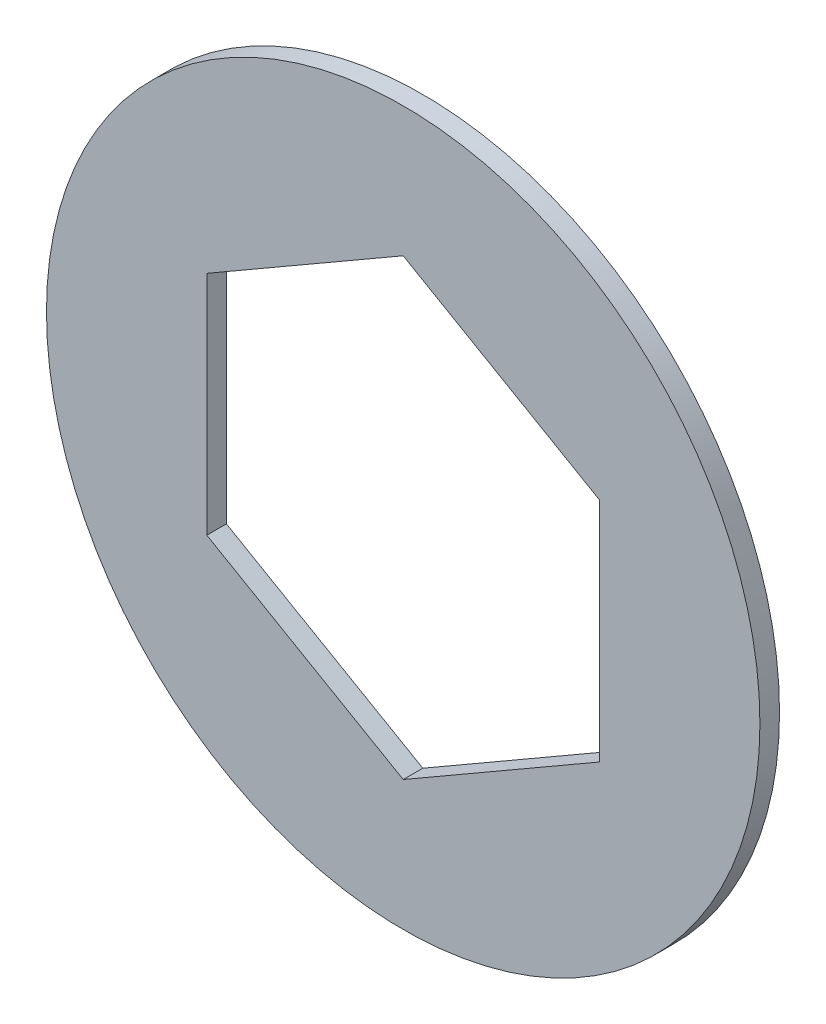
ISO-10303-21;
HEADER;
FILE_DESCRIPTION(('STEP AP214'),'2;1');
FILE_NAME('part.step','',(''),(''),'','','');
FILE_SCHEMA(('AUTOMOTIVE_DESIGN { 1 0 10303 214 1 1 1 1 }'));
ENDSEC;
DATA;
#1=APPLICATION_CONTEXT('core data for automotive mechanical design processes');
#2=APPLICATION_PROTOCOL_DEFINITION('international standard','automotive_design',2000,#1);
#3=PRODUCT_CONTEXT('',#1,'mechanical');
#4=PRODUCT('Part','Part','',(#3));
#5=PRODUCT_RELATED_PRODUCT_CATEGORY('part','',(#4));
#6=PRODUCT_DEFINITION_FORMATION('','',#4);
#7=PRODUCT_DEFINITION_CONTEXT('part definition',#1,'design');
#8=PRODUCT_DEFINITION('design','',#6,#7);
#9=PRODUCT_DEFINITION_SHAPE('','',#8);
#10=(LENGTH_UNIT() NAMED_UNIT(*) SI_UNIT(.MILLI.,.METRE.));
#11=(NAMED_UNIT(*) PLANE_ANGLE_UNIT() SI_UNIT($,.RADIAN.));
#12=(NAMED_UNIT(*) SI_UNIT($,.STERADIAN.) SOLID_ANGLE_UNIT());
#13=UNCERTAINTY_MEASURE_WITH_UNIT(LENGTH_MEASURE(1.E-05),#10,'distance_accuracy_value','');
#14=(GEOMETRIC_REPRESENTATION_CONTEXT(3) GLOBAL_UNCERTAINTY_ASSIGNED_CONTEXT((#13)) GLOBAL_UNIT_ASSIGNED_CONTEXT((#10,
#11,#12)) REPRESENTATION_CONTEXT('',''));
#15=CARTESIAN_POINT('',(0.,0.,0.));
#16=DIRECTION('',(0.,0.,1.));
#17=DIRECTION('',(1.,0.,0.));
#18=AXIS2_PLACEMENT_3D('',#15,#16,#17);
#19=CARTESIAN_POINT('',(0.,0.,2.5));
#20=DIRECTION('',(0.,0.,1.));
#21=DIRECTION('',(1.,0.,0.));
#22=AXIS2_PLACEMENT_3D('',#19,#20,#21);
#23=PLANE('',#22);
#24=CARTESIAN_POINT('',(0.,0.,2.5));
#25=DIRECTION('',(0.,0.,1.));
#26=DIRECTION('',(1.,0.,0.));
#27=AXIS2_PLACEMENT_3D('',#24,#25,#26);
#28=CIRCLE('',#27,45.5);
#29=CARTESIAN_POINT('',(45.5,0.,2.5));
#30=VERTEX_POINT('',#29);
#31=EDGE_CURVE('E11',#30,#30,#28,.T.);
#32=ORIENTED_EDGE('',*,*,#31,.T.);
#33=EDGE_LOOP('',(#32));
#34=FACE_BOUND('',#33,.T.);
#35=DIRECTION('',(-0.866025403784438,-0.5,0.));
#36=VECTOR('',#35,1.);
#37=CARTESIAN_POINT('',(0.,28.9252484864003,2.5));
#38=LINE('',#37,#36);
#39=CARTESIAN_POINT('',(0.,28.9252484864003,2.5));
#40=VERTEX_POINT('',#39);
#41=CARTESIAN_POINT('',(-25.05,14.4626242432001,2.5));
#42=VERTEX_POINT('',#41);
#43=EDGE_CURVE('E93',#40,#42,#38,.T.);
#44=ORIENTED_EDGE('',*,*,#43,.F.);
#45=DIRECTION('',(-0.866025403784439,0.5,0.));
#46=VECTOR('',#45,1.);
#47=CARTESIAN_POINT('',(25.05,14.4626242432001,2.5));
#48=LINE('',#47,#46);
#49=CARTESIAN_POINT('',(25.05,14.4626242432001,2.5));
#50=VERTEX_POINT('',#49);
#51=EDGE_CURVE('E85',#50,#40,#48,.T.);
#52=ORIENTED_EDGE('',*,*,#51,.F.);
#53=DIRECTION('',(0.,1.,0.));
#54=VECTOR('',#53,1.);
#55=CARTESIAN_POINT('',(25.05,-14.4626242432001,2.5));
#56=LINE('',#55,#54);
#57=CARTESIAN_POINT('',(25.05,-14.4626242432001,2.5));
#58=VERTEX_POINT('',#57);
#59=EDGE_CURVE('E113',#58,#50,#56,.T.);
#60=ORIENTED_EDGE('',*,*,#59,.F.);
#61=DIRECTION('',(0.866025403784439,0.5,0.));
#62=VECTOR('',#61,1.);
#63=CARTESIAN_POINT('',(0.,-28.9252484864002,2.5));
#64=LINE('',#63,#62);
#65=CARTESIAN_POINT('',(0.,-28.9252484864002,2.5));
#66=VERTEX_POINT('',#65);
#67=EDGE_CURVE('E111',#66,#58,#64,.T.);
#68=ORIENTED_EDGE('',*,*,#67,.F.);
#69=DIRECTION('',(0.866025403784439,-0.5,0.));
#70=VECTOR('',#69,1.);
#71=CARTESIAN_POINT('',(-25.05,-14.4626242432001,2.5));
#72=LINE('',#71,#70);
#73=CARTESIAN_POINT('',(-25.05,-14.4626242432001,2.5));
#74=VERTEX_POINT('',#73);
#75=EDGE_CURVE('E107',#74,#66,#72,.T.);
#76=ORIENTED_EDGE('',*,*,#75,.F.);
#77=DIRECTION('',(0.,-1.,0.));
#78=VECTOR('',#77,1.);
#79=CARTESIAN_POINT('',(-25.05,14.4626242432001,2.5));
#80=LINE('',#79,#78);
#81=EDGE_CURVE('E105',#42,#74,#80,.T.);
#82=ORIENTED_EDGE('',*,*,#81,.F.);
#83=EDGE_LOOP('',(#44,#52,#60,#68,#76,#82));
#84=FACE_BOUND('',#83,.T.);
#85=ADVANCED_FACE('F32',(#34,#84),#23,.T.);
#86=CARTESIAN_POINT('',(0.,0.,0.));
#87=DIRECTION('',(0.,0.,1.));
#88=DIRECTION('',(1.,0.,0.));
#89=AXIS2_PLACEMENT_3D('',#86,#87,#88);
#90=PLANE('',#89);
#91=CARTESIAN_POINT('',(0.,0.,0.));
#92=DIRECTION('',(0.,0.,1.));
#93=DIRECTION('',(1.,0.,0.));
#94=AXIS2_PLACEMENT_3D('',#91,#92,#93);
#95=CIRCLE('',#94,45.5);
#96=CARTESIAN_POINT('',(45.5,0.,0.));
#97=VERTEX_POINT('',#96);
#98=EDGE_CURVE('E36',#97,#97,#95,.T.);
#99=ORIENTED_EDGE('',*,*,#98,.F.);
#100=EDGE_LOOP('',(#99));
#101=FACE_BOUND('',#100,.T.);
#102=DIRECTION('',(-0.866025403784439,0.5,0.));
#103=VECTOR('',#102,1.);
#104=CARTESIAN_POINT('',(25.05,14.4626242432001,0.));
#105=LINE('',#104,#103);
#106=CARTESIAN_POINT('',(25.05,14.4626242432001,0.));
#107=VERTEX_POINT('',#106);
#108=CARTESIAN_POINT('',(0.,28.9252484864003,0.));
#109=VERTEX_POINT('',#108);
#110=EDGE_CURVE('E55',#107,#109,#105,.T.);
#111=ORIENTED_EDGE('',*,*,#110,.T.);
#112=DIRECTION('',(-0.866025403784438,-0.5,0.));
#113=VECTOR('',#112,1.);
#114=CARTESIAN_POINT('',(0.,28.9252484864003,0.));
#115=LINE('',#114,#113);
#116=CARTESIAN_POINT('',(-25.05,14.4626242432001,0.));
#117=VERTEX_POINT('',#116);
#118=EDGE_CURVE('E100',#109,#117,#115,.T.);
#119=ORIENTED_EDGE('',*,*,#118,.T.);
#120=DIRECTION('',(0.,-1.,0.));
#121=VECTOR('',#120,1.);
#122=CARTESIAN_POINT('',(-25.05,14.4626242432001,0.));
#123=LINE('',#122,#121);
#124=CARTESIAN_POINT('',(-25.05,-14.4626242432001,0.));
#125=VERTEX_POINT('',#124);
#126=EDGE_CURVE('E117',#117,#125,#123,.T.);
#127=ORIENTED_EDGE('',*,*,#126,.T.);
#128=DIRECTION('',(0.866025403784439,-0.5,0.));
#129=VECTOR('',#128,1.);
#130=CARTESIAN_POINT('',(-25.05,-14.4626242432001,0.));
#131=LINE('',#130,#129);
#132=CARTESIAN_POINT('',(0.,-28.9252484864002,0.));
#133=VERTEX_POINT('',#132);
#134=EDGE_CURVE('E120',#125,#133,#131,.T.);
#135=ORIENTED_EDGE('',*,*,#134,.T.);
#136=DIRECTION('',(0.866025403784439,0.5,0.));
#137=VECTOR('',#136,1.);
#138=CARTESIAN_POINT('',(0.,-28.9252484864002,0.));
#139=LINE('',#138,#137);
#140=CARTESIAN_POINT('',(25.05,-14.4626242432001,0.));
#141=VERTEX_POINT('',#140);
#142=EDGE_CURVE('E123',#133,#141,#139,.T.);
#143=ORIENTED_EDGE('',*,*,#142,.T.);
#144=DIRECTION('',(0.,1.,0.));
#145=VECTOR('',#144,1.);
#146=CARTESIAN_POINT('',(25.05,-14.4626242432001,0.));
#147=LINE('',#146,#145);
#148=EDGE_CURVE('E94',#141,#107,#147,.T.);
#149=ORIENTED_EDGE('',*,*,#148,.T.);
#150=EDGE_LOOP('',(#111,#119,#127,#135,#143,#149));
#151=FACE_BOUND('',#150,.T.);
#152=ADVANCED_FACE('F140',(#101,#151),#90,.F.);
#153=CARTESIAN_POINT('',(0.,0.,2.5));
#154=DIRECTION('',(0.,0.,-1.));
#155=DIRECTION('',(-1.,0.,0.));
#156=AXIS2_PLACEMENT_3D('',#153,#154,#155);
#157=CYLINDRICAL_SURFACE('',#156,45.5);
#158=ORIENTED_EDGE('',*,*,#31,.F.);
#159=EDGE_LOOP('',(#158));
#160=FACE_BOUND('',#159,.T.);
#161=ORIENTED_EDGE('',*,*,#98,.T.);
#162=EDGE_LOOP('',(#161));
#163=FACE_BOUND('',#162,.T.);
#164=ADVANCED_FACE('F34',(#160,#163),#157,.T.);
#165=CARTESIAN_POINT('',(25.05,14.4626242432001,2.5));
#166=DIRECTION('',(-0.5,-0.866025403784439,0.));
#167=DIRECTION('',(0.866025403784439,-0.5,0.));
#168=AXIS2_PLACEMENT_3D('',#165,#166,#167);
#169=PLANE('',#168);
#170=ORIENTED_EDGE('',*,*,#110,.F.);
#171=DIRECTION('',(0.,0.,-1.));
#172=VECTOR('',#171,1.);
#173=CARTESIAN_POINT('',(25.05,14.4626242432001,2.5));
#174=LINE('',#173,#172);
#175=EDGE_CURVE('E89',#50,#107,#174,.T.);
#176=ORIENTED_EDGE('',*,*,#175,.F.);
#177=ORIENTED_EDGE('',*,*,#51,.T.);
#178=DIRECTION('',(0.,0.,-1.));
#179=VECTOR('',#178,1.);
#180=CARTESIAN_POINT('',(0.,28.9252484864003,2.5));
#181=LINE('',#180,#179);
#182=EDGE_CURVE('E88',#40,#109,#181,.T.);
#183=ORIENTED_EDGE('',*,*,#182,.T.);
#184=EDGE_LOOP('',(#170,#176,#177,#183));
#185=FACE_BOUND('',#184,.T.);
#186=ADVANCED_FACE('F87',(#185),#169,.T.);
#187=CARTESIAN_POINT('',(0.,28.9252484864003,2.5));
#188=DIRECTION('',(0.5,-0.866025403784438,0.));
#189=DIRECTION('',(0.866025403784439,0.5,0.));
#190=AXIS2_PLACEMENT_3D('',#187,#188,#189);
#191=PLANE('',#190);
#192=ORIENTED_EDGE('',*,*,#118,.F.);
#193=ORIENTED_EDGE('',*,*,#182,.F.);
#194=ORIENTED_EDGE('',*,*,#43,.T.);
#195=DIRECTION('',(0.,0.,-1.));
#196=VECTOR('',#195,1.);
#197=CARTESIAN_POINT('',(-25.05,14.4626242432001,2.5));
#198=LINE('',#197,#196);
#199=EDGE_CURVE('E101',#42,#117,#198,.T.);
#200=ORIENTED_EDGE('',*,*,#199,.T.);
#201=EDGE_LOOP('',(#192,#193,#194,#200));
#202=FACE_BOUND('',#201,.T.);
#203=ADVANCED_FACE('F97',(#202),#191,.T.);
#204=CARTESIAN_POINT('',(-25.05,14.4626242432001,2.5));
#205=DIRECTION('',(1.,0.,0.));
#206=DIRECTION('',(0.,0.,-1.));
#207=AXIS2_PLACEMENT_3D('',#204,#205,#206);
#208=PLANE('',#207);
#209=ORIENTED_EDGE('',*,*,#126,.F.);
#210=ORIENTED_EDGE('',*,*,#199,.F.);
#211=ORIENTED_EDGE('',*,*,#81,.T.);
#212=DIRECTION('',(0.,0.,-1.));
#213=VECTOR('',#212,1.);
#214=CARTESIAN_POINT('',(-25.05,-14.4626242432001,2.5));
#215=LINE('',#214,#213);
#216=EDGE_CURVE('E132',#74,#125,#215,.T.);
#217=ORIENTED_EDGE('',*,*,#216,.T.);
#218=EDGE_LOOP('',(#209,#210,#211,#217));
#219=FACE_BOUND('',#218,.T.);
#220=ADVANCED_FACE('F136',(#219),#208,.T.);
#221=CARTESIAN_POINT('',(-25.05,-14.4626242432001,2.5));
#222=DIRECTION('',(0.5,0.866025403784439,0.));
#223=DIRECTION('',(-0.866025403784439,0.5,0.));
#224=AXIS2_PLACEMENT_3D('',#221,#222,#223);
#225=PLANE('',#224);
#226=ORIENTED_EDGE('',*,*,#134,.F.);
#227=ORIENTED_EDGE('',*,*,#216,.F.);
#228=ORIENTED_EDGE('',*,*,#75,.T.);
#229=DIRECTION('',(0.,0.,-1.));
#230=VECTOR('',#229,1.);
#231=CARTESIAN_POINT('',(0.,-28.9252484864002,2.5));
#232=LINE('',#231,#230);
#233=EDGE_CURVE('E130',#66,#133,#232,.T.);
#234=ORIENTED_EDGE('',*,*,#233,.T.);
#235=EDGE_LOOP('',(#226,#227,#228,#234));
#236=FACE_BOUND('',#235,.T.);
#237=ADVANCED_FACE('F148',(#236),#225,.T.);
#238=CARTESIAN_POINT('',(0.,-28.9252484864002,2.5));
#239=DIRECTION('',(-0.5,0.866025403784439,0.));
#240=DIRECTION('',(-0.866025403784439,-0.5,0.));
#241=AXIS2_PLACEMENT_3D('',#238,#239,#240);
#242=PLANE('',#241);
#243=ORIENTED_EDGE('',*,*,#142,.F.);
#244=ORIENTED_EDGE('',*,*,#233,.F.);
#245=ORIENTED_EDGE('',*,*,#67,.T.);
#246=DIRECTION('',(0.,0.,-1.));
#247=VECTOR('',#246,1.);
#248=CARTESIAN_POINT('',(25.05,-14.4626242432001,2.5));
#249=LINE('',#248,#247);
#250=EDGE_CURVE('E47',#58,#141,#249,.T.);
#251=ORIENTED_EDGE('',*,*,#250,.T.);
#252=EDGE_LOOP('',(#243,#244,#245,#251));
#253=FACE_BOUND('',#252,.T.);
#254=ADVANCED_FACE('F146',(#253),#242,.T.);
#255=CARTESIAN_POINT('',(25.05,-14.4626242432001,2.5));
#256=DIRECTION('',(-1.,0.,0.));
#257=DIRECTION('',(0.,-1.,0.));
#258=AXIS2_PLACEMENT_3D('',#255,#256,#257);
#259=PLANE('',#258);
#260=ORIENTED_EDGE('',*,*,#148,.F.);
#261=ORIENTED_EDGE('',*,*,#250,.F.);
#262=ORIENTED_EDGE('',*,*,#59,.T.);
#263=ORIENTED_EDGE('',*,*,#175,.T.);
#264=EDGE_LOOP('',(#260,#261,#262,#263));
#265=FACE_BOUND('',#264,.T.);
#266=ADVANCED_FACE('F142',(#265),#259,.T.);
#267=CLOSED_SHELL('',(#85,#152,#164,#186,#203,#220,#237,#254,#266));
#268=MANIFOLD_SOLID_BREP('B2',#267);
#269=ADVANCED_BREP_SHAPE_REPRESENTATION('',(#18,#268),#14);
#270=SHAPE_DEFINITION_REPRESENTATION(#9,#269);
ENDSEC;
END-ISO-10303-21;
